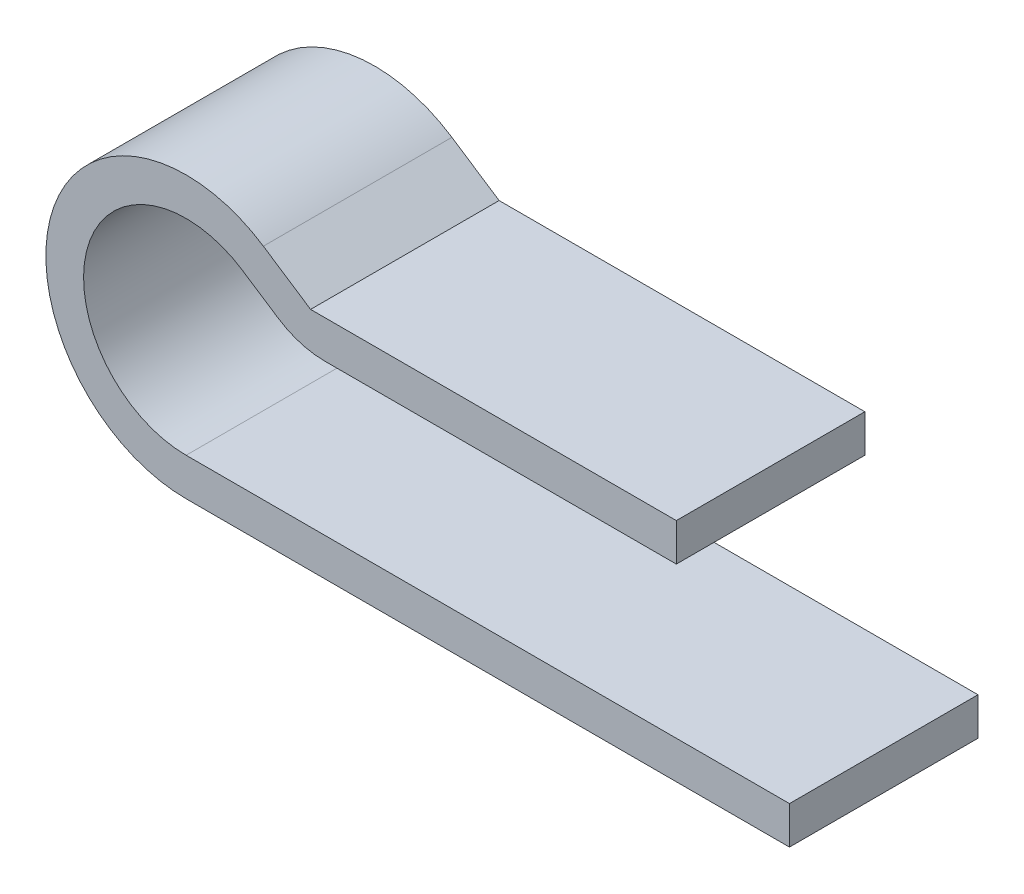
ISO-10303-21;
HEADER;
FILE_DESCRIPTION(('STEP AP214'),'2;1');
FILE_NAME('part.step','',(''),(''),'','','');
FILE_SCHEMA(('AUTOMOTIVE_DESIGN { 1 0 10303 214 1 1 1 1 }'));
ENDSEC;
DATA;
#1=APPLICATION_CONTEXT('core data for automotive mechanical design processes');
#2=APPLICATION_PROTOCOL_DEFINITION('international standard','automotive_design',2000,#1);
#3=PRODUCT_CONTEXT('',#1,'mechanical');
#4=PRODUCT('Part','Part','',(#3));
#5=PRODUCT_RELATED_PRODUCT_CATEGORY('part','',(#4));
#6=PRODUCT_DEFINITION_FORMATION('','',#4);
#7=PRODUCT_DEFINITION_CONTEXT('part definition',#1,'design');
#8=PRODUCT_DEFINITION('design','',#6,#7);
#9=PRODUCT_DEFINITION_SHAPE('','',#8);
#10=(LENGTH_UNIT() NAMED_UNIT(*) SI_UNIT(.MILLI.,.METRE.));
#11=(NAMED_UNIT(*) PLANE_ANGLE_UNIT() SI_UNIT($,.RADIAN.));
#12=(NAMED_UNIT(*) SI_UNIT($,.STERADIAN.) SOLID_ANGLE_UNIT());
#13=UNCERTAINTY_MEASURE_WITH_UNIT(LENGTH_MEASURE(1.E-05),#10,'distance_accuracy_value','');
#14=(GEOMETRIC_REPRESENTATION_CONTEXT(3) GLOBAL_UNCERTAINTY_ASSIGNED_CONTEXT((#13)) GLOBAL_UNIT_ASSIGNED_CONTEXT((#10,
#11,#12)) REPRESENTATION_CONTEXT('',''));
#15=CARTESIAN_POINT('',(0.,0.,0.));
#16=DIRECTION('',(0.,0.,1.));
#17=DIRECTION('',(1.,0.,0.));
#18=AXIS2_PLACEMENT_3D('',#15,#16,#17);
#19=CARTESIAN_POINT('',(1.6,0.,1.));
#20=DIRECTION('',(-1.,0.,0.));
#21=DIRECTION('',(0.,-1.,0.));
#22=AXIS2_PLACEMENT_3D('',#19,#20,#21);
#23=PLANE('',#22);
#24=DIRECTION('',(0.,1.,0.));
#25=VECTOR('',#24,1.);
#26=CARTESIAN_POINT('',(1.6,0.,0.));
#27=LINE('',#26,#25);
#28=CARTESIAN_POINT('',(1.6,-0.2,0.));
#29=VERTEX_POINT('',#28);
#30=CARTESIAN_POINT('',(1.6,0.,0.));
#31=VERTEX_POINT('',#30);
#32=EDGE_CURVE('E145',#29,#31,#27,.T.);
#33=ORIENTED_EDGE('',*,*,#32,.T.);
#34=DIRECTION('',(0.,0.,-1.));
#35=VECTOR('',#34,1.);
#36=CARTESIAN_POINT('',(1.6,0.,1.));
#37=LINE('',#36,#35);
#38=CARTESIAN_POINT('',(1.6,0.,1.));
#39=VERTEX_POINT('',#38);
#40=EDGE_CURVE('E126',#39,#31,#37,.T.);
#41=ORIENTED_EDGE('',*,*,#40,.F.);
#42=DIRECTION('',(0.,1.,0.));
#43=VECTOR('',#42,1.);
#44=CARTESIAN_POINT('',(1.6,0.,1.));
#45=LINE('',#44,#43);
#46=CARTESIAN_POINT('',(1.6,-0.2,1.));
#47=VERTEX_POINT('',#46);
#48=EDGE_CURVE('E133',#47,#39,#45,.T.);
#49=ORIENTED_EDGE('',*,*,#48,.F.);
#50=DIRECTION('',(0.,0.,-1.));
#51=VECTOR('',#50,1.);
#52=CARTESIAN_POINT('',(1.6,-0.2,1.));
#53=LINE('',#52,#51);
#54=EDGE_CURVE('E171',#47,#29,#53,.T.);
#55=ORIENTED_EDGE('',*,*,#54,.T.);
#56=EDGE_LOOP('',(#33,#41,#49,#55));
#57=FACE_BOUND('',#56,.T.);
#58=ADVANCED_FACE('F39',(#57),#23,.F.);
#59=CARTESIAN_POINT('',(-1.6,0.,1.));
#60=DIRECTION('',(0.,-1.,0.));
#61=DIRECTION('',(0.,0.,-1.));
#62=AXIS2_PLACEMENT_3D('',#59,#60,#61);
#63=PLANE('',#62);
#64=DIRECTION('',(-1.,0.,0.));
#65=VECTOR('',#64,1.);
#66=CARTESIAN_POINT('',(-1.6,0.,0.));
#67=LINE('',#66,#65);
#68=CARTESIAN_POINT('',(-1.6,0.,0.));
#69=VERTEX_POINT('',#68);
#70=EDGE_CURVE('E188',#31,#69,#67,.T.);
#71=ORIENTED_EDGE('',*,*,#70,.T.);
#72=DIRECTION('',(0.,0.,-1.));
#73=VECTOR('',#72,1.);
#74=CARTESIAN_POINT('',(-1.6,0.,1.));
#75=LINE('',#74,#73);
#76=CARTESIAN_POINT('',(-1.6,0.,1.));
#77=VERTEX_POINT('',#76);
#78=EDGE_CURVE('E129',#77,#69,#75,.T.);
#79=ORIENTED_EDGE('',*,*,#78,.F.);
#80=DIRECTION('',(-1.,0.,0.));
#81=VECTOR('',#80,1.);
#82=CARTESIAN_POINT('',(-1.6,0.,1.));
#83=LINE('',#82,#81);
#84=EDGE_CURVE('E122',#39,#77,#83,.T.);
#85=ORIENTED_EDGE('',*,*,#84,.F.);
#86=ORIENTED_EDGE('',*,*,#40,.T.);
#87=EDGE_LOOP('',(#71,#79,#85,#86));
#88=FACE_BOUND('',#87,.T.);
#89=ADVANCED_FACE('F124',(#88),#63,.F.);
#90=CARTESIAN_POINT('',(-1.6,0.544,1.));
#91=DIRECTION('',(0.,0.,-1.));
#92=DIRECTION('',(-1.,0.,0.));
#93=AXIS2_PLACEMENT_3D('',#90,#91,#92);
#94=CYLINDRICAL_SURFACE('',#93,0.544);
#95=CARTESIAN_POINT('',(-1.6,0.544,0.));
#96=DIRECTION('',(0.,0.,-1.));
#97=DIRECTION('',(-1.,0.,0.));
#98=AXIS2_PLACEMENT_3D('',#95,#96,#97);
#99=CIRCLE('',#98,0.544);
#100=CARTESIAN_POINT('',(-1.3005504587156,0.998165137614679,0.));
#101=VERTEX_POINT('',#100);
#102=EDGE_CURVE('E186',#69,#101,#99,.T.);
#103=ORIENTED_EDGE('',*,*,#102,.T.);
#104=DIRECTION('',(0.,0.,-1.));
#105=VECTOR('',#104,1.);
#106=CARTESIAN_POINT('',(-1.3005504587156,0.998165137614679,1.));
#107=LINE('',#106,#105);
#108=CARTESIAN_POINT('',(-1.3005504587156,0.998165137614679,1.));
#109=VERTEX_POINT('',#108);
#110=EDGE_CURVE('E150',#109,#101,#107,.T.);
#111=ORIENTED_EDGE('',*,*,#110,.F.);
#112=CARTESIAN_POINT('',(-1.6,0.544,1.));
#113=DIRECTION('',(0.,0.,-1.));
#114=DIRECTION('',(-1.,0.,0.));
#115=AXIS2_PLACEMENT_3D('',#112,#113,#114);
#116=CIRCLE('',#115,0.544);
#117=EDGE_CURVE('E132',#77,#109,#116,.T.);
#118=ORIENTED_EDGE('',*,*,#117,.F.);
#119=ORIENTED_EDGE('',*,*,#78,.T.);
#120=EDGE_LOOP('',(#103,#111,#118,#119));
#121=FACE_BOUND('',#120,.T.);
#122=ADVANCED_FACE('F207',(#121),#94,.F.);
#123=CARTESIAN_POINT('',(-1.3005504587156,0.998165137614679,1.));
#124=DIRECTION('',(0.550458715596331,0.834862385321101,0.));
#125=DIRECTION('',(-0.834862385321101,0.550458715596331,0.));
#126=AXIS2_PLACEMENT_3D('',#123,#124,#125);
#127=PLANE('',#126);
#128=DIRECTION('',(0.834862385321101,-0.550458715596331,0.));
#129=VECTOR('',#128,1.);
#130=CARTESIAN_POINT('',(-1.3005504587156,0.998165137614679,0.));
#131=LINE('',#130,#129);
#132=CARTESIAN_POINT('',(-1.11270642201835,0.874311926605505,0.));
#133=VERTEX_POINT('',#132);
#134=EDGE_CURVE('E184',#101,#133,#131,.T.);
#135=ORIENTED_EDGE('',*,*,#134,.T.);
#136=DIRECTION('',(0.,0.,-1.));
#137=VECTOR('',#136,1.);
#138=CARTESIAN_POINT('',(-1.11270642201835,0.874311926605505,1.));
#139=LINE('',#138,#137);
#140=CARTESIAN_POINT('',(-1.11270642201835,0.874311926605505,1.));
#141=VERTEX_POINT('',#140);
#142=EDGE_CURVE('E47',#133,#141,#139,.F.);
#143=ORIENTED_EDGE('',*,*,#142,.T.);
#144=DIRECTION('',(0.834862385321101,-0.550458715596331,0.));
#145=VECTOR('',#144,1.);
#146=CARTESIAN_POINT('',(-1.3005504587156,0.998165137614679,1.));
#147=LINE('',#146,#145);
#148=EDGE_CURVE('E202',#109,#141,#147,.T.);
#149=ORIENTED_EDGE('',*,*,#148,.F.);
#150=ORIENTED_EDGE('',*,*,#110,.T.);
#151=EDGE_LOOP('',(#135,#143,#149,#150));
#152=FACE_BOUND('',#151,.T.);
#153=ADVANCED_FACE('F209',(#152),#127,.F.);
#154=CARTESIAN_POINT('',(-1.,0.8,1.));
#155=DIRECTION('',(0.,1.,0.));
#156=DIRECTION('',(0.,0.,1.));
#157=AXIS2_PLACEMENT_3D('',#154,#155,#156);
#158=PLANE('',#157);
#159=DIRECTION('',(1.,0.,0.));
#160=VECTOR('',#159,1.);
#161=CARTESIAN_POINT('',(-1.,0.8,1.));
#162=LINE('',#161,#160);
#163=CARTESIAN_POINT('',(-0.865,0.8,1.));
#164=VERTEX_POINT('',#163);
#165=CARTESIAN_POINT('',(1.,0.8,1.));
#166=VERTEX_POINT('',#165);
#167=EDGE_CURVE('E200',#164,#166,#162,.T.);
#168=ORIENTED_EDGE('',*,*,#167,.F.);
#169=DIRECTION('',(0.,0.,-1.));
#170=VECTOR('',#169,1.);
#171=CARTESIAN_POINT('',(-0.865,0.8,1.));
#172=LINE('',#171,#170);
#173=CARTESIAN_POINT('',(-0.865,0.8,0.));
#174=VERTEX_POINT('',#173);
#175=EDGE_CURVE('E146',#164,#174,#172,.T.);
#176=ORIENTED_EDGE('',*,*,#175,.T.);
#177=DIRECTION('',(1.,0.,0.));
#178=VECTOR('',#177,1.);
#179=CARTESIAN_POINT('',(-1.,0.8,0.));
#180=LINE('',#179,#178);
#181=CARTESIAN_POINT('',(1.,0.8,0.));
#182=VERTEX_POINT('',#181);
#183=EDGE_CURVE('E182',#174,#182,#180,.T.);
#184=ORIENTED_EDGE('',*,*,#183,.T.);
#185=DIRECTION('',(0.,0.,-1.));
#186=VECTOR('',#185,1.);
#187=CARTESIAN_POINT('',(1.,0.8,1.));
#188=LINE('',#187,#186);
#189=EDGE_CURVE('E156',#166,#182,#188,.T.);
#190=ORIENTED_EDGE('',*,*,#189,.F.);
#191=EDGE_LOOP('',(#168,#176,#184,#190));
#192=FACE_BOUND('',#191,.T.);
#193=ADVANCED_FACE('F211',(#192),#158,.F.);
#194=CARTESIAN_POINT('',(1.,1.,1.));
#195=DIRECTION('',(-1.,0.,0.));
#196=DIRECTION('',(0.,0.,1.));
#197=AXIS2_PLACEMENT_3D('',#194,#195,#196);
#198=PLANE('',#197);
#199=DIRECTION('',(0.,1.,0.));
#200=VECTOR('',#199,1.);
#201=CARTESIAN_POINT('',(1.,1.,0.));
#202=LINE('',#201,#200);
#203=CARTESIAN_POINT('',(1.,1.,0.));
#204=VERTEX_POINT('',#203);
#205=EDGE_CURVE('E180',#182,#204,#202,.T.);
#206=ORIENTED_EDGE('',*,*,#205,.T.);
#207=DIRECTION('',(0.,0.,-1.));
#208=VECTOR('',#207,1.);
#209=CARTESIAN_POINT('',(1.,1.,1.));
#210=LINE('',#209,#208);
#211=CARTESIAN_POINT('',(1.,1.,1.));
#212=VERTEX_POINT('',#211);
#213=EDGE_CURVE('E159',#212,#204,#210,.T.);
#214=ORIENTED_EDGE('',*,*,#213,.F.);
#215=DIRECTION('',(0.,1.,0.));
#216=VECTOR('',#215,1.);
#217=CARTESIAN_POINT('',(1.,1.,1.));
#218=LINE('',#217,#216);
#219=EDGE_CURVE('E198',#166,#212,#218,.T.);
#220=ORIENTED_EDGE('',*,*,#219,.F.);
#221=ORIENTED_EDGE('',*,*,#189,.T.);
#222=EDGE_LOOP('',(#206,#214,#220,#221));
#223=FACE_BOUND('',#222,.T.);
#224=ADVANCED_FACE('F217',(#223),#198,.F.);
#225=CARTESIAN_POINT('',(-0.94,1.,1.));
#226=DIRECTION('',(0.,-1.,0.));
#227=DIRECTION('',(1.,0.,0.));
#228=AXIS2_PLACEMENT_3D('',#225,#226,#227);
#229=PLANE('',#228);
#230=DIRECTION('',(-1.,0.,0.));
#231=VECTOR('',#230,1.);
#232=CARTESIAN_POINT('',(-0.94,1.,0.));
#233=LINE('',#232,#231);
#234=CARTESIAN_POINT('',(-0.94,1.,0.));
#235=VERTEX_POINT('',#234);
#236=EDGE_CURVE('E178',#204,#235,#233,.T.);
#237=ORIENTED_EDGE('',*,*,#236,.T.);
#238=DIRECTION('',(0.,0.,-1.));
#239=VECTOR('',#238,1.);
#240=CARTESIAN_POINT('',(-0.94,1.,1.));
#241=LINE('',#240,#239);
#242=CARTESIAN_POINT('',(-0.94,1.,1.));
#243=VERTEX_POINT('',#242);
#244=EDGE_CURVE('E162',#243,#235,#241,.T.);
#245=ORIENTED_EDGE('',*,*,#244,.F.);
#246=DIRECTION('',(-1.,0.,0.));
#247=VECTOR('',#246,1.);
#248=CARTESIAN_POINT('',(-0.94,1.,1.));
#249=LINE('',#248,#247);
#250=EDGE_CURVE('E196',#212,#243,#249,.T.);
#251=ORIENTED_EDGE('',*,*,#250,.F.);
#252=ORIENTED_EDGE('',*,*,#213,.T.);
#253=EDGE_LOOP('',(#237,#245,#251,#252));
#254=FACE_BOUND('',#253,.T.);
#255=ADVANCED_FACE('F242',(#254),#229,.F.);
#256=CARTESIAN_POINT('',(-1.19045871559633,1.1651376146789,1.));
#257=DIRECTION('',(-0.55045871559633,-0.834862385321101,0.));
#258=DIRECTION('',(0.834862385321101,-0.55045871559633,0.));
#259=AXIS2_PLACEMENT_3D('',#256,#257,#258);
#260=PLANE('',#259);
#261=DIRECTION('',(-0.834862385321101,0.55045871559633,0.));
#262=VECTOR('',#261,1.);
#263=CARTESIAN_POINT('',(-1.19045871559633,1.1651376146789,0.));
#264=LINE('',#263,#262);
#265=CARTESIAN_POINT('',(-1.19045871559633,1.1651376146789,0.));
#266=VERTEX_POINT('',#265);
#267=EDGE_CURVE('E176',#235,#266,#264,.T.);
#268=ORIENTED_EDGE('',*,*,#267,.T.);
#269=DIRECTION('',(0.,0.,-1.));
#270=VECTOR('',#269,1.);
#271=CARTESIAN_POINT('',(-1.19045871559633,1.1651376146789,1.));
#272=LINE('',#271,#270);
#273=CARTESIAN_POINT('',(-1.19045871559633,1.1651376146789,1.));
#274=VERTEX_POINT('',#273);
#275=EDGE_CURVE('E165',#274,#266,#272,.T.);
#276=ORIENTED_EDGE('',*,*,#275,.F.);
#277=DIRECTION('',(-0.834862385321101,0.55045871559633,0.));
#278=VECTOR('',#277,1.);
#279=CARTESIAN_POINT('',(-1.19045871559633,1.1651376146789,1.));
#280=LINE('',#279,#278);
#281=EDGE_CURVE('E194',#243,#274,#280,.T.);
#282=ORIENTED_EDGE('',*,*,#281,.F.);
#283=ORIENTED_EDGE('',*,*,#244,.T.);
#284=EDGE_LOOP('',(#268,#276,#282,#283));
#285=FACE_BOUND('',#284,.T.);
#286=ADVANCED_FACE('F253',(#285),#260,.F.);
#287=CARTESIAN_POINT('',(-1.6,0.544,1.));
#288=DIRECTION('',(0.,0.,-1.));
#289=DIRECTION('',(-1.,0.,0.));
#290=AXIS2_PLACEMENT_3D('',#287,#288,#289);
#291=CYLINDRICAL_SURFACE('',#290,0.744);
#292=CARTESIAN_POINT('',(-1.6,0.544,0.));
#293=DIRECTION('',(0.,0.,1.));
#294=DIRECTION('',(-1.,0.,0.));
#295=AXIS2_PLACEMENT_3D('',#292,#293,#294);
#296=CIRCLE('',#295,0.744);
#297=CARTESIAN_POINT('',(-1.6,-0.2,0.));
#298=VERTEX_POINT('',#297);
#299=EDGE_CURVE('E174',#266,#298,#296,.T.);
#300=ORIENTED_EDGE('',*,*,#299,.T.);
#301=DIRECTION('',(0.,0.,-1.));
#302=VECTOR('',#301,1.);
#303=CARTESIAN_POINT('',(-1.6,-0.2,1.));
#304=LINE('',#303,#302);
#305=CARTESIAN_POINT('',(-1.6,-0.2,1.));
#306=VERTEX_POINT('',#305);
#307=EDGE_CURVE('E168',#306,#298,#304,.T.);
#308=ORIENTED_EDGE('',*,*,#307,.F.);
#309=CARTESIAN_POINT('',(-1.6,0.544,1.));
#310=DIRECTION('',(0.,0.,1.));
#311=DIRECTION('',(-1.,0.,0.));
#312=AXIS2_PLACEMENT_3D('',#309,#310,#311);
#313=CIRCLE('',#312,0.744);
#314=EDGE_CURVE('E192',#274,#306,#313,.T.);
#315=ORIENTED_EDGE('',*,*,#314,.F.);
#316=ORIENTED_EDGE('',*,*,#275,.T.);
#317=EDGE_LOOP('',(#300,#308,#315,#316));
#318=FACE_BOUND('',#317,.T.);
#319=ADVANCED_FACE('F263',(#318),#291,.T.);
#320=CARTESIAN_POINT('',(-1.6,-0.2,1.));
#321=DIRECTION('',(0.,1.,0.));
#322=DIRECTION('',(-1.,0.,0.));
#323=AXIS2_PLACEMENT_3D('',#320,#321,#322);
#324=PLANE('',#323);
#325=DIRECTION('',(1.,0.,0.));
#326=VECTOR('',#325,1.);
#327=CARTESIAN_POINT('',(-1.6,-0.2,0.));
#328=LINE('',#327,#326);
#329=EDGE_CURVE('E142',#298,#29,#328,.T.);
#330=ORIENTED_EDGE('',*,*,#329,.T.);
#331=ORIENTED_EDGE('',*,*,#54,.F.);
#332=DIRECTION('',(1.,0.,0.));
#333=VECTOR('',#332,1.);
#334=CARTESIAN_POINT('',(-1.6,-0.2,1.));
#335=LINE('',#334,#333);
#336=EDGE_CURVE('E138',#306,#47,#335,.T.);
#337=ORIENTED_EDGE('',*,*,#336,.F.);
#338=ORIENTED_EDGE('',*,*,#307,.T.);
#339=EDGE_LOOP('',(#330,#331,#337,#338));
#340=FACE_BOUND('',#339,.T.);
#341=ADVANCED_FACE('F273',(#340),#324,.F.);
#342=CARTESIAN_POINT('',(-1.6,0.544,1.));
#343=DIRECTION('',(0.,0.,-1.));
#344=DIRECTION('',(-1.,0.,0.));
#345=AXIS2_PLACEMENT_3D('',#342,#343,#344);
#346=PLANE('',#345);
#347=ORIENTED_EDGE('',*,*,#148,.T.);
#348=CARTESIAN_POINT('',(-0.865,1.25,1.));
#349=DIRECTION('',(0.,0.,-1.));
#350=DIRECTION('',(-1.,0.,0.));
#351=AXIS2_PLACEMENT_3D('',#348,#349,#350);
#352=CIRCLE('',#351,0.45);
#353=EDGE_CURVE('E11',#141,#164,#352,.F.);
#354=ORIENTED_EDGE('',*,*,#353,.T.);
#355=ORIENTED_EDGE('',*,*,#167,.T.);
#356=ORIENTED_EDGE('',*,*,#219,.T.);
#357=ORIENTED_EDGE('',*,*,#250,.T.);
#358=ORIENTED_EDGE('',*,*,#281,.T.);
#359=ORIENTED_EDGE('',*,*,#314,.T.);
#360=ORIENTED_EDGE('',*,*,#336,.T.);
#361=ORIENTED_EDGE('',*,*,#48,.T.);
#362=ORIENTED_EDGE('',*,*,#84,.T.);
#363=ORIENTED_EDGE('',*,*,#117,.T.);
#364=EDGE_LOOP('',(#347,#354,#355,#356,#357,#358,#359,#360,#361,#362,#363));
#365=FACE_BOUND('',#364,.T.);
#366=ADVANCED_FACE('F136',(#365),#346,.F.);
#367=CARTESIAN_POINT('',(-1.6,0.544,0.));
#368=DIRECTION('',(0.,0.,-1.));
#369=DIRECTION('',(-1.,0.,0.));
#370=AXIS2_PLACEMENT_3D('',#367,#368,#369);
#371=PLANE('',#370);
#372=ORIENTED_EDGE('',*,*,#183,.F.);
#373=CARTESIAN_POINT('',(-0.865,1.25,0.));
#374=DIRECTION('',(0.,0.,-1.));
#375=DIRECTION('',(-1.,0.,0.));
#376=AXIS2_PLACEMENT_3D('',#373,#374,#375);
#377=CIRCLE('',#376,0.45);
#378=EDGE_CURVE('E61',#174,#133,#377,.T.);
#379=ORIENTED_EDGE('',*,*,#378,.T.);
#380=ORIENTED_EDGE('',*,*,#134,.F.);
#381=ORIENTED_EDGE('',*,*,#102,.F.);
#382=ORIENTED_EDGE('',*,*,#70,.F.);
#383=ORIENTED_EDGE('',*,*,#32,.F.);
#384=ORIENTED_EDGE('',*,*,#329,.F.);
#385=ORIENTED_EDGE('',*,*,#299,.F.);
#386=ORIENTED_EDGE('',*,*,#267,.F.);
#387=ORIENTED_EDGE('',*,*,#236,.F.);
#388=ORIENTED_EDGE('',*,*,#205,.F.);
#389=EDGE_LOOP('',(#372,#379,#380,#381,#382,#383,#384,#385,#386,#387,#388));
#390=FACE_BOUND('',#389,.T.);
#391=ADVANCED_FACE('F300',(#390),#371,.T.);
#392=CARTESIAN_POINT('',(-0.865,1.25,1.));
#393=DIRECTION('',(0.,0.,-1.));
#394=DIRECTION('',(-1.,0.,0.));
#395=AXIS2_PLACEMENT_3D('',#392,#393,#394);
#396=CYLINDRICAL_SURFACE('',#395,0.45);
#397=ORIENTED_EDGE('',*,*,#353,.F.);
#398=ORIENTED_EDGE('',*,*,#142,.F.);
#399=ORIENTED_EDGE('',*,*,#378,.F.);
#400=ORIENTED_EDGE('',*,*,#175,.F.);
#401=EDGE_LOOP('',(#397,#398,#399,#400));
#402=FACE_BOUND('',#401,.T.);
#403=ADVANCED_FACE('F41',(#402),#396,.T.);
#404=CLOSED_SHELL('',(#58,#89,#122,#153,#193,#224,#255,#286,#319,#341,#366,#391,#403));
#405=MANIFOLD_SOLID_BREP('B2',#404);
#406=ADVANCED_BREP_SHAPE_REPRESENTATION('',(#18,#405),#14);
#407=SHAPE_DEFINITION_REPRESENTATION(#9,#406);
ENDSEC;
END-ISO-10303-21;
